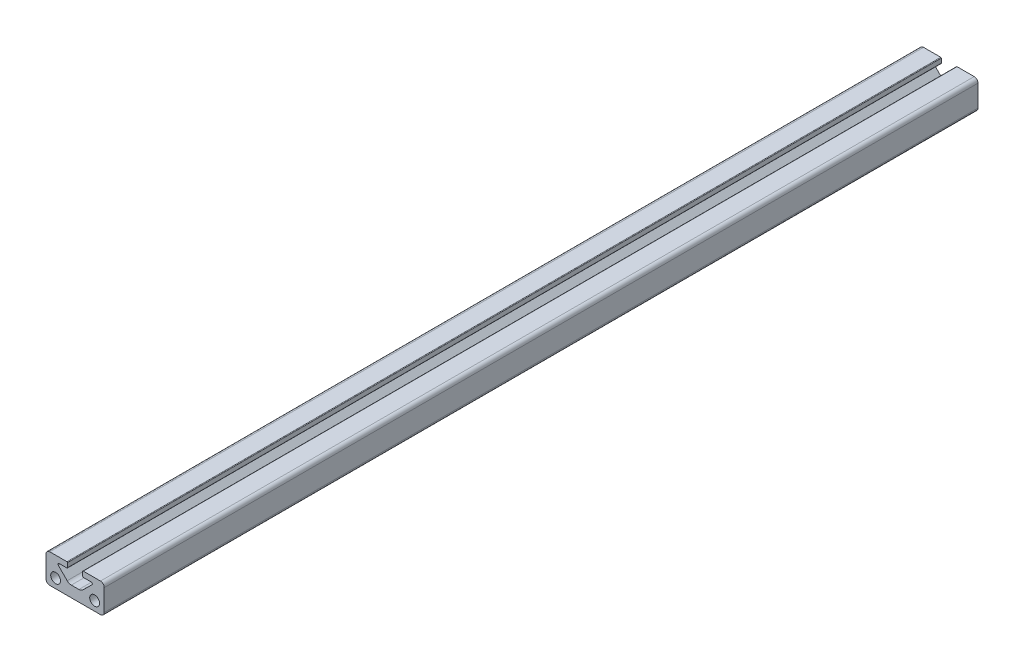
ISO-10303-21;
HEADER;
FILE_DESCRIPTION(('STEP AP214'),'2;1');
FILE_NAME('part.step','',(''),(''),'','','');
FILE_SCHEMA(('AUTOMOTIVE_DESIGN { 1 0 10303 214 1 1 1 1 }'));
ENDSEC;
DATA;
#1=APPLICATION_CONTEXT('core data for automotive mechanical design processes');
#2=APPLICATION_PROTOCOL_DEFINITION('international standard','automotive_design',2000,#1);
#3=PRODUCT_CONTEXT('',#1,'mechanical');
#4=PRODUCT('Part','Part','',(#3));
#5=PRODUCT_RELATED_PRODUCT_CATEGORY('part','',(#4));
#6=PRODUCT_DEFINITION_FORMATION('','',#4);
#7=PRODUCT_DEFINITION_CONTEXT('part definition',#1,'design');
#8=PRODUCT_DEFINITION('design','',#6,#7);
#9=PRODUCT_DEFINITION_SHAPE('','',#8);
#10=(LENGTH_UNIT() NAMED_UNIT(*) SI_UNIT(.MILLI.,.METRE.));
#11=(NAMED_UNIT(*) PLANE_ANGLE_UNIT() SI_UNIT($,.RADIAN.));
#12=(NAMED_UNIT(*) SI_UNIT($,.STERADIAN.) SOLID_ANGLE_UNIT());
#13=UNCERTAINTY_MEASURE_WITH_UNIT(LENGTH_MEASURE(1.E-05),#10,'distance_accuracy_value','');
#14=(GEOMETRIC_REPRESENTATION_CONTEXT(3) GLOBAL_UNCERTAINTY_ASSIGNED_CONTEXT((#13)) GLOBAL_UNIT_ASSIGNED_CONTEXT((#10,
#11,#12)) REPRESENTATION_CONTEXT('',''));
#15=CARTESIAN_POINT('',(0.,0.,0.));
#16=DIRECTION('',(0.,0.,1.));
#17=DIRECTION('',(1.,0.,0.));
#18=AXIS2_PLACEMENT_3D('',#15,#16,#17);
#19=CARTESIAN_POINT('',(-11.049,11.049,190.5));
#20=DIRECTION('',(0.,0.,1.));
#21=DIRECTION('',(1.,0.,0.));
#22=AXIS2_PLACEMENT_3D('',#19,#20,#21);
#23=PLANE('',#22);
#24=CARTESIAN_POINT('',(8.509,4.064,190.5));
#25=DIRECTION('',(0.,0.,1.));
#26=DIRECTION('',(1.,0.,0.));
#27=AXIS2_PLACEMENT_3D('',#24,#25,#26);
#28=CIRCLE('',#27,2.1463);
#29=CARTESIAN_POINT('',(10.6553,4.064,190.5));
#30=VERTEX_POINT('',#29);
#31=EDGE_CURVE('E513',#30,#30,#28,.T.);
#32=ORIENTED_EDGE('',*,*,#31,.F.);
#33=EDGE_LOOP('',(#32));
#34=FACE_BOUND('',#33,.T.);
#35=DIRECTION('',(0.,-1.,0.));
#36=VECTOR('',#35,1.);
#37=CARTESIAN_POINT('',(3.302,12.7,190.5));
#38=LINE('',#37,#36);
#39=CARTESIAN_POINT('',(3.302,12.446,190.5));
#40=VERTEX_POINT('',#39);
#41=CARTESIAN_POINT('',(3.302,10.582863886556,190.5));
#42=VERTEX_POINT('',#41);
#43=EDGE_CURVE('E480',#40,#42,#38,.T.);
#44=ORIENTED_EDGE('',*,*,#43,.T.);
#45=CARTESIAN_POINT('',(3.556,10.582863886556,190.5));
#46=DIRECTION('',(0.,0.,1.));
#47=DIRECTION('',(1.,0.,0.));
#48=AXIS2_PLACEMENT_3D('',#45,#46,#47);
#49=CIRCLE('',#48,0.254);
#50=CARTESIAN_POINT('',(3.556,10.328863886556,190.5));
#51=VERTEX_POINT('',#50);
#52=EDGE_CURVE('E269',#42,#51,#49,.T.);
#53=ORIENTED_EDGE('',*,*,#52,.T.);
#54=DIRECTION('',(1.,0.,0.));
#55=VECTOR('',#54,1.);
#56=CARTESIAN_POINT('',(3.302,10.328863886556,190.5));
#57=LINE('',#56,#55);
#58=CARTESIAN_POINT('',(6.985,10.328863886556,190.5));
#59=VERTEX_POINT('',#58);
#60=EDGE_CURVE('E472',#51,#59,#57,.T.);
#61=ORIENTED_EDGE('',*,*,#60,.T.);
#62=CARTESIAN_POINT('',(6.985,9.82086388655604,190.5));
#63=DIRECTION('',(0.,0.,-1.));
#64=DIRECTION('',(1.,0.,0.));
#65=AXIS2_PLACEMENT_3D('',#62,#63,#64);
#66=CIRCLE('',#65,0.508);
#67=CARTESIAN_POINT('',(7.34421024484277,9.46165364171327,190.5));
#68=VERTEX_POINT('',#67);
#69=EDGE_CURVE('E465',#59,#68,#66,.T.);
#70=ORIENTED_EDGE('',*,*,#69,.T.);
#71=DIRECTION('',(-0.707106781186546,-0.707106781186549,0.));
#72=VECTOR('',#71,1.);
#73=CARTESIAN_POINT('',(7.34421024484277,9.46165364171327,190.5));
#74=LINE('',#73,#72);
#75=CARTESIAN_POINT('',(3.45250537891568,5.56994877578617,190.5));
#76=VERTEX_POINT('',#75);
#77=EDGE_CURVE('E460',#68,#76,#74,.T.);
#78=ORIENTED_EDGE('',*,*,#77,.T.);
#79=CARTESIAN_POINT('',(1.65645415470184,7.366,190.5));
#80=DIRECTION('',(0.,0.,-1.));
#81=DIRECTION('',(1.,0.,0.));
#82=AXIS2_PLACEMENT_3D('',#79,#80,#81);
#83=CIRCLE('',#82,2.54);
#84=CARTESIAN_POINT('',(1.65645415470184,4.826,190.5));
#85=VERTEX_POINT('',#84);
#86=EDGE_CURVE('E456',#76,#85,#83,.T.);
#87=ORIENTED_EDGE('',*,*,#86,.T.);
#88=DIRECTION('',(-1.,0.,0.));
#89=VECTOR('',#88,1.);
#90=CARTESIAN_POINT('',(1.65645415470184,4.826,190.5));
#91=LINE('',#90,#89);
#92=CARTESIAN_POINT('',(-1.65645415470184,4.826,190.5));
#93=VERTEX_POINT('',#92);
#94=EDGE_CURVE('E447',#85,#93,#91,.T.);
#95=ORIENTED_EDGE('',*,*,#94,.T.);
#96=CARTESIAN_POINT('',(-1.65645415470184,7.366,190.5));
#97=DIRECTION('',(0.,0.,-1.));
#98=DIRECTION('',(1.,0.,0.));
#99=AXIS2_PLACEMENT_3D('',#96,#97,#98);
#100=CIRCLE('',#99,2.54);
#101=CARTESIAN_POINT('',(-3.45250537891568,5.56994877578617,190.5));
#102=VERTEX_POINT('',#101);
#103=EDGE_CURVE('E442',#93,#102,#100,.T.);
#104=ORIENTED_EDGE('',*,*,#103,.T.);
#105=DIRECTION('',(-0.707106781186546,0.707106781186549,0.));
#106=VECTOR('',#105,1.);
#107=CARTESIAN_POINT('',(-3.45250537891568,5.56994877578617,190.5));
#108=LINE('',#107,#106);
#109=CARTESIAN_POINT('',(-7.34421024484277,9.46165364171327,190.5));
#110=VERTEX_POINT('',#109);
#111=EDGE_CURVE('E438',#102,#110,#108,.T.);
#112=ORIENTED_EDGE('',*,*,#111,.T.);
#113=CARTESIAN_POINT('',(-6.985,9.82086388655604,190.5));
#114=DIRECTION('',(0.,0.,-1.));
#115=DIRECTION('',(1.,0.,0.));
#116=AXIS2_PLACEMENT_3D('',#113,#114,#115);
#117=CIRCLE('',#116,0.507999999999999);
#118=CARTESIAN_POINT('',(-6.985,10.328863886556,190.5));
#119=VERTEX_POINT('',#118);
#120=EDGE_CURVE('E294',#110,#119,#117,.T.);
#121=ORIENTED_EDGE('',*,*,#120,.T.);
#122=DIRECTION('',(1.,0.,0.));
#123=VECTOR('',#122,1.);
#124=CARTESIAN_POINT('',(-6.985,10.328863886556,190.5));
#125=LINE('',#124,#123);
#126=CARTESIAN_POINT('',(-3.556,10.328863886556,190.5));
#127=VERTEX_POINT('',#126);
#128=EDGE_CURVE('E288',#119,#127,#125,.T.);
#129=ORIENTED_EDGE('',*,*,#128,.T.);
#130=CARTESIAN_POINT('',(-3.556,10.582863886556,190.5));
#131=DIRECTION('',(0.,0.,1.));
#132=DIRECTION('',(1.,0.,0.));
#133=AXIS2_PLACEMENT_3D('',#130,#131,#132);
#134=CIRCLE('',#133,0.254);
#135=CARTESIAN_POINT('',(-3.302,10.582863886556,190.5));
#136=VERTEX_POINT('',#135);
#137=EDGE_CURVE('E263',#127,#136,#134,.T.);
#138=ORIENTED_EDGE('',*,*,#137,.T.);
#139=DIRECTION('',(0.,1.,0.));
#140=VECTOR('',#139,1.);
#141=CARTESIAN_POINT('',(-3.302,12.7,190.5));
#142=LINE('',#141,#140);
#143=CARTESIAN_POINT('',(-3.302,12.446,190.5));
#144=VERTEX_POINT('',#143);
#145=EDGE_CURVE('E297',#136,#144,#142,.T.);
#146=ORIENTED_EDGE('',*,*,#145,.T.);
#147=CARTESIAN_POINT('',(-3.556,12.446,190.5));
#148=DIRECTION('',(0.,0.,1.));
#149=DIRECTION('',(1.,0.,0.));
#150=AXIS2_PLACEMENT_3D('',#147,#148,#149);
#151=CIRCLE('',#150,0.254);
#152=CARTESIAN_POINT('',(-3.556,12.7,190.5));
#153=VERTEX_POINT('',#152);
#154=EDGE_CURVE('E57',#144,#153,#151,.T.);
#155=ORIENTED_EDGE('',*,*,#154,.T.);
#156=DIRECTION('',(-1.,0.,0.));
#157=VECTOR('',#156,1.);
#158=CARTESIAN_POINT('',(-11.049,12.7,190.5));
#159=LINE('',#158,#157);
#160=CARTESIAN_POINT('',(-11.049,12.7,190.5));
#161=VERTEX_POINT('',#160);
#162=EDGE_CURVE('E221',#153,#161,#159,.T.);
#163=ORIENTED_EDGE('',*,*,#162,.T.);
#164=CARTESIAN_POINT('',(-11.049,11.049,190.5));
#165=DIRECTION('',(0.,0.,1.));
#166=DIRECTION('',(1.,0.,0.));
#167=AXIS2_PLACEMENT_3D('',#164,#165,#166);
#168=CIRCLE('',#167,1.651);
#169=CARTESIAN_POINT('',(-12.7,11.049,190.5));
#170=VERTEX_POINT('',#169);
#171=EDGE_CURVE('E216',#161,#170,#168,.T.);
#172=ORIENTED_EDGE('',*,*,#171,.T.);
#173=DIRECTION('',(0.,-1.,0.));
#174=VECTOR('',#173,1.);
#175=CARTESIAN_POINT('',(-12.7,11.049,190.5));
#176=LINE('',#175,#174);
#177=CARTESIAN_POINT('',(-12.7,1.65099999999999,190.5));
#178=VERTEX_POINT('',#177);
#179=EDGE_CURVE('E205',#170,#178,#176,.T.);
#180=ORIENTED_EDGE('',*,*,#179,.T.);
#181=CARTESIAN_POINT('',(-11.049,1.65099999999999,190.5));
#182=DIRECTION('',(0.,0.,1.));
#183=DIRECTION('',(1.,0.,0.));
#184=AXIS2_PLACEMENT_3D('',#181,#182,#183);
#185=CIRCLE('',#184,1.651);
#186=CARTESIAN_POINT('',(-11.049,0.,190.5));
#187=VERTEX_POINT('',#186);
#188=EDGE_CURVE('E215',#178,#187,#185,.T.);
#189=ORIENTED_EDGE('',*,*,#188,.T.);
#190=DIRECTION('',(1.,0.,0.));
#191=VECTOR('',#190,1.);
#192=CARTESIAN_POINT('',(11.049,0.,190.5));
#193=LINE('',#192,#191);
#194=CARTESIAN_POINT('',(11.049,0.,190.5));
#195=VERTEX_POINT('',#194);
#196=EDGE_CURVE('E376',#187,#195,#193,.T.);
#197=ORIENTED_EDGE('',*,*,#196,.T.);
#198=CARTESIAN_POINT('',(11.049,1.651,190.5));
#199=DIRECTION('',(0.,0.,1.));
#200=DIRECTION('',(1.,0.,0.));
#201=AXIS2_PLACEMENT_3D('',#198,#199,#200);
#202=CIRCLE('',#201,1.651);
#203=CARTESIAN_POINT('',(12.7,1.651,190.5));
#204=VERTEX_POINT('',#203);
#205=EDGE_CURVE('E519',#195,#204,#202,.T.);
#206=ORIENTED_EDGE('',*,*,#205,.T.);
#207=DIRECTION('',(0.,1.,0.));
#208=VECTOR('',#207,1.);
#209=CARTESIAN_POINT('',(12.7,1.651,190.5));
#210=LINE('',#209,#208);
#211=CARTESIAN_POINT('',(12.7,11.049,190.5));
#212=VERTEX_POINT('',#211);
#213=EDGE_CURVE('E524',#204,#212,#210,.T.);
#214=ORIENTED_EDGE('',*,*,#213,.T.);
#215=CARTESIAN_POINT('',(11.049,11.049,190.5));
#216=DIRECTION('',(0.,0.,1.));
#217=DIRECTION('',(1.,0.,0.));
#218=AXIS2_PLACEMENT_3D('',#215,#216,#217);
#219=CIRCLE('',#218,1.651);
#220=CARTESIAN_POINT('',(11.049,12.7,190.5));
#221=VERTEX_POINT('',#220);
#222=EDGE_CURVE('E490',#212,#221,#219,.T.);
#223=ORIENTED_EDGE('',*,*,#222,.T.);
#224=DIRECTION('',(-1.,0.,0.));
#225=VECTOR('',#224,1.);
#226=CARTESIAN_POINT('',(3.302,12.7,190.5));
#227=LINE('',#226,#225);
#228=CARTESIAN_POINT('',(3.556,12.7,190.5));
#229=VERTEX_POINT('',#228);
#230=EDGE_CURVE('E485',#221,#229,#227,.T.);
#231=ORIENTED_EDGE('',*,*,#230,.T.);
#232=CARTESIAN_POINT('',(3.556,12.446,190.5));
#233=DIRECTION('',(0.,0.,1.));
#234=DIRECTION('',(1.,0.,0.));
#235=AXIS2_PLACEMENT_3D('',#232,#233,#234);
#236=CIRCLE('',#235,0.254);
#237=EDGE_CURVE('E266',#229,#40,#236,.T.);
#238=ORIENTED_EDGE('',*,*,#237,.T.);
#239=EDGE_LOOP('',(#44,#53,#61,#70,#78,#87,#95,#104,#112,#121,#129,#138,#146,#155,#163,#172,
#180,#189,#197,#206,#214,#223,#231,#238));
#240=FACE_BOUND('',#239,.T.);
#241=CARTESIAN_POINT('',(-8.509,4.064,190.5));
#242=DIRECTION('',(0.,0.,1.));
#243=DIRECTION('',(1.,0.,0.));
#244=AXIS2_PLACEMENT_3D('',#241,#242,#243);
#245=CIRCLE('',#244,2.1463);
#246=CARTESIAN_POINT('',(-6.3627,4.064,190.5));
#247=VERTEX_POINT('',#246);
#248=EDGE_CURVE('E782',#247,#247,#245,.T.);
#249=ORIENTED_EDGE('',*,*,#248,.F.);
#250=EDGE_LOOP('',(#249));
#251=FACE_BOUND('',#250,.T.);
#252=ADVANCED_FACE('F41',(#34,#240,#251),#23,.T.);
#253=CARTESIAN_POINT('',(-11.049,11.049,-190.5));
#254=DIRECTION('',(0.,0.,1.));
#255=DIRECTION('',(1.,0.,0.));
#256=AXIS2_PLACEMENT_3D('',#253,#254,#255);
#257=PLANE('',#256);
#258=DIRECTION('',(1.,0.,0.));
#259=VECTOR('',#258,1.);
#260=CARTESIAN_POINT('',(3.302,10.328863886556,-190.5));
#261=LINE('',#260,#259);
#262=CARTESIAN_POINT('',(3.556,10.328863886556,-190.5));
#263=VERTEX_POINT('',#262);
#264=CARTESIAN_POINT('',(6.985,10.328863886556,-190.5));
#265=VERTEX_POINT('',#264);
#266=EDGE_CURVE('E406',#263,#265,#261,.T.);
#267=ORIENTED_EDGE('',*,*,#266,.F.);
#268=CARTESIAN_POINT('',(3.556,10.582863886556,-190.5));
#269=DIRECTION('',(0.,0.,1.));
#270=DIRECTION('',(1.,0.,0.));
#271=AXIS2_PLACEMENT_3D('',#268,#269,#270);
#272=CIRCLE('',#271,0.254);
#273=CARTESIAN_POINT('',(3.302,10.582863886556,-190.5));
#274=VERTEX_POINT('',#273);
#275=EDGE_CURVE('E251',#263,#274,#272,.F.);
#276=ORIENTED_EDGE('',*,*,#275,.T.);
#277=DIRECTION('',(0.,-1.,0.));
#278=VECTOR('',#277,1.);
#279=CARTESIAN_POINT('',(3.302,12.7,-190.5));
#280=LINE('',#279,#278);
#281=CARTESIAN_POINT('',(3.302,12.446,-190.5));
#282=VERTEX_POINT('',#281);
#283=EDGE_CURVE('E402',#282,#274,#280,.T.);
#284=ORIENTED_EDGE('',*,*,#283,.F.);
#285=CARTESIAN_POINT('',(3.556,12.446,-190.5));
#286=DIRECTION('',(0.,0.,1.));
#287=DIRECTION('',(1.,0.,0.));
#288=AXIS2_PLACEMENT_3D('',#285,#286,#287);
#289=CIRCLE('',#288,0.254);
#290=CARTESIAN_POINT('',(3.556,12.7,-190.5));
#291=VERTEX_POINT('',#290);
#292=EDGE_CURVE('E248',#282,#291,#289,.F.);
#293=ORIENTED_EDGE('',*,*,#292,.T.);
#294=DIRECTION('',(-1.,0.,0.));
#295=VECTOR('',#294,1.);
#296=CARTESIAN_POINT('',(3.302,12.7,-190.5));
#297=LINE('',#296,#295);
#298=CARTESIAN_POINT('',(11.049,12.7,-190.5));
#299=VERTEX_POINT('',#298);
#300=EDGE_CURVE('E398',#299,#291,#297,.T.);
#301=ORIENTED_EDGE('',*,*,#300,.F.);
#302=CARTESIAN_POINT('',(11.049,11.049,-190.5));
#303=DIRECTION('',(0.,0.,1.));
#304=DIRECTION('',(1.,0.,0.));
#305=AXIS2_PLACEMENT_3D('',#302,#303,#304);
#306=CIRCLE('',#305,1.651);
#307=CARTESIAN_POINT('',(12.7,11.049,-190.5));
#308=VERTEX_POINT('',#307);
#309=EDGE_CURVE('E395',#308,#299,#306,.T.);
#310=ORIENTED_EDGE('',*,*,#309,.F.);
#311=DIRECTION('',(0.,1.,0.));
#312=VECTOR('',#311,1.);
#313=CARTESIAN_POINT('',(12.7,1.651,-190.5));
#314=LINE('',#313,#312);
#315=CARTESIAN_POINT('',(12.7,1.651,-190.5));
#316=VERTEX_POINT('',#315);
#317=EDGE_CURVE('E387',#316,#308,#314,.T.);
#318=ORIENTED_EDGE('',*,*,#317,.F.);
#319=CARTESIAN_POINT('',(11.049,1.651,-190.5));
#320=DIRECTION('',(0.,0.,1.));
#321=DIRECTION('',(1.,0.,0.));
#322=AXIS2_PLACEMENT_3D('',#319,#320,#321);
#323=CIRCLE('',#322,1.651);
#324=CARTESIAN_POINT('',(11.049,0.,-190.5));
#325=VERTEX_POINT('',#324);
#326=EDGE_CURVE('E382',#325,#316,#323,.T.);
#327=ORIENTED_EDGE('',*,*,#326,.F.);
#328=DIRECTION('',(1.,0.,0.));
#329=VECTOR('',#328,1.);
#330=CARTESIAN_POINT('',(11.049,0.,-190.5));
#331=LINE('',#330,#329);
#332=CARTESIAN_POINT('',(-11.049,0.,-190.5));
#333=VERTEX_POINT('',#332);
#334=EDGE_CURVE('E375',#333,#325,#331,.T.);
#335=ORIENTED_EDGE('',*,*,#334,.F.);
#336=CARTESIAN_POINT('',(-11.049,1.65099999999999,-190.5));
#337=DIRECTION('',(0.,0.,1.));
#338=DIRECTION('',(1.,0.,0.));
#339=AXIS2_PLACEMENT_3D('',#336,#337,#338);
#340=CIRCLE('',#339,1.651);
#341=CARTESIAN_POINT('',(-12.7,1.65099999999999,-190.5));
#342=VERTEX_POINT('',#341);
#343=EDGE_CURVE('E380',#342,#333,#340,.T.);
#344=ORIENTED_EDGE('',*,*,#343,.F.);
#345=DIRECTION('',(0.,-1.,0.));
#346=VECTOR('',#345,1.);
#347=CARTESIAN_POINT('',(-12.7,11.049,-190.5));
#348=LINE('',#347,#346);
#349=CARTESIAN_POINT('',(-12.7,11.049,-190.5));
#350=VERTEX_POINT('',#349);
#351=EDGE_CURVE('E389',#350,#342,#348,.T.);
#352=ORIENTED_EDGE('',*,*,#351,.F.);
#353=CARTESIAN_POINT('',(-11.049,11.049,-190.5));
#354=DIRECTION('',(0.,0.,1.));
#355=DIRECTION('',(1.,0.,0.));
#356=AXIS2_PLACEMENT_3D('',#353,#354,#355);
#357=CIRCLE('',#356,1.651);
#358=CARTESIAN_POINT('',(-11.049,12.7,-190.5));
#359=VERTEX_POINT('',#358);
#360=EDGE_CURVE('E230',#359,#350,#357,.T.);
#361=ORIENTED_EDGE('',*,*,#360,.F.);
#362=DIRECTION('',(-1.,0.,0.));
#363=VECTOR('',#362,1.);
#364=CARTESIAN_POINT('',(-11.049,12.7,-190.5));
#365=LINE('',#364,#363);
#366=CARTESIAN_POINT('',(-3.556,12.7,-190.5));
#367=VERTEX_POINT('',#366);
#368=EDGE_CURVE('E226',#367,#359,#365,.T.);
#369=ORIENTED_EDGE('',*,*,#368,.F.);
#370=CARTESIAN_POINT('',(-3.556,12.446,-190.5));
#371=DIRECTION('',(0.,0.,1.));
#372=DIRECTION('',(1.,0.,0.));
#373=AXIS2_PLACEMENT_3D('',#370,#371,#372);
#374=CIRCLE('',#373,0.254);
#375=CARTESIAN_POINT('',(-3.302,12.446,-190.5));
#376=VERTEX_POINT('',#375);
#377=EDGE_CURVE('E237',#367,#376,#374,.F.);
#378=ORIENTED_EDGE('',*,*,#377,.T.);
#379=DIRECTION('',(0.,1.,0.));
#380=VECTOR('',#379,1.);
#381=CARTESIAN_POINT('',(-3.302,12.7,-190.5));
#382=LINE('',#381,#380);
#383=CARTESIAN_POINT('',(-3.302,10.582863886556,-190.5));
#384=VERTEX_POINT('',#383);
#385=EDGE_CURVE('E303',#384,#376,#382,.T.);
#386=ORIENTED_EDGE('',*,*,#385,.F.);
#387=CARTESIAN_POINT('',(-3.556,10.582863886556,-190.5));
#388=DIRECTION('',(0.,0.,1.));
#389=DIRECTION('',(1.,0.,0.));
#390=AXIS2_PLACEMENT_3D('',#387,#388,#389);
#391=CIRCLE('',#390,0.254);
#392=CARTESIAN_POINT('',(-3.556,10.328863886556,-190.5));
#393=VERTEX_POINT('',#392);
#394=EDGE_CURVE('E245',#384,#393,#391,.F.);
#395=ORIENTED_EDGE('',*,*,#394,.T.);
#396=DIRECTION('',(1.,0.,0.));
#397=VECTOR('',#396,1.);
#398=CARTESIAN_POINT('',(-6.985,10.328863886556,-190.5));
#399=LINE('',#398,#397);
#400=CARTESIAN_POINT('',(-6.985,10.328863886556,-190.5));
#401=VERTEX_POINT('',#400);
#402=EDGE_CURVE('E290',#401,#393,#399,.T.);
#403=ORIENTED_EDGE('',*,*,#402,.F.);
#404=CARTESIAN_POINT('',(-6.985,9.82086388655604,-190.5));
#405=DIRECTION('',(0.,0.,-1.));
#406=DIRECTION('',(1.,0.,0.));
#407=AXIS2_PLACEMENT_3D('',#404,#405,#406);
#408=CIRCLE('',#407,0.507999999999999);
#409=CARTESIAN_POINT('',(-7.34421024484277,9.46165364171327,-190.5));
#410=VERTEX_POINT('',#409);
#411=EDGE_CURVE('E314',#410,#401,#408,.T.);
#412=ORIENTED_EDGE('',*,*,#411,.F.);
#413=DIRECTION('',(-0.707106781186546,0.707106781186549,0.));
#414=VECTOR('',#413,1.);
#415=CARTESIAN_POINT('',(-3.45250537891568,5.56994877578617,-190.5));
#416=LINE('',#415,#414);
#417=CARTESIAN_POINT('',(-3.45250537891568,5.56994877578617,-190.5));
#418=VERTEX_POINT('',#417);
#419=EDGE_CURVE('E424',#418,#410,#416,.T.);
#420=ORIENTED_EDGE('',*,*,#419,.F.);
#421=CARTESIAN_POINT('',(-1.65645415470184,7.366,-190.5));
#422=DIRECTION('',(0.,0.,-1.));
#423=DIRECTION('',(1.,0.,0.));
#424=AXIS2_PLACEMENT_3D('',#421,#422,#423);
#425=CIRCLE('',#424,2.54);
#426=CARTESIAN_POINT('',(-1.65645415470184,4.826,-190.5));
#427=VERTEX_POINT('',#426);
#428=EDGE_CURVE('E421',#427,#418,#425,.T.);
#429=ORIENTED_EDGE('',*,*,#428,.F.);
#430=DIRECTION('',(-1.,0.,0.));
#431=VECTOR('',#430,1.);
#432=CARTESIAN_POINT('',(1.65645415470184,4.826,-190.5));
#433=LINE('',#432,#431);
#434=CARTESIAN_POINT('',(1.65645415470184,4.826,-190.5));
#435=VERTEX_POINT('',#434);
#436=EDGE_CURVE('E418',#435,#427,#433,.T.);
#437=ORIENTED_EDGE('',*,*,#436,.F.);
#438=CARTESIAN_POINT('',(1.65645415470184,7.366,-190.5));
#439=DIRECTION('',(0.,0.,-1.));
#440=DIRECTION('',(1.,0.,0.));
#441=AXIS2_PLACEMENT_3D('',#438,#439,#440);
#442=CIRCLE('',#441,2.54);
#443=CARTESIAN_POINT('',(3.45250537891568,5.56994877578617,-190.5));
#444=VERTEX_POINT('',#443);
#445=EDGE_CURVE('E415',#444,#435,#442,.T.);
#446=ORIENTED_EDGE('',*,*,#445,.F.);
#447=DIRECTION('',(-0.707106781186546,-0.707106781186549,0.));
#448=VECTOR('',#447,1.);
#449=CARTESIAN_POINT('',(7.34421024484277,9.46165364171327,-190.5));
#450=LINE('',#449,#448);
#451=CARTESIAN_POINT('',(7.34421024484277,9.46165364171327,-190.5));
#452=VERTEX_POINT('',#451);
#453=EDGE_CURVE('E412',#452,#444,#450,.T.);
#454=ORIENTED_EDGE('',*,*,#453,.F.);
#455=CARTESIAN_POINT('',(6.985,9.82086388655604,-190.5));
#456=DIRECTION('',(0.,0.,-1.));
#457=DIRECTION('',(1.,0.,0.));
#458=AXIS2_PLACEMENT_3D('',#455,#456,#457);
#459=CIRCLE('',#458,0.508);
#460=EDGE_CURVE('E409',#265,#452,#459,.T.);
#461=ORIENTED_EDGE('',*,*,#460,.F.);
#462=EDGE_LOOP('',(#267,#276,#284,#293,#301,#310,#318,#327,#335,#344,#352,#361,#369,#378,#386,
#395,#403,#412,#420,#429,#437,#446,#454,#461));
#463=FACE_BOUND('',#462,.T.);
#464=CARTESIAN_POINT('',(8.509,4.064,-190.5));
#465=DIRECTION('',(0.,0.,1.));
#466=DIRECTION('',(1.,0.,0.));
#467=AXIS2_PLACEMENT_3D('',#464,#465,#466);
#468=CIRCLE('',#467,2.1463);
#469=CARTESIAN_POINT('',(10.6553,4.064,-190.5));
#470=VERTEX_POINT('',#469);
#471=EDGE_CURVE('E790',#470,#470,#468,.T.);
#472=ORIENTED_EDGE('',*,*,#471,.T.);
#473=EDGE_LOOP('',(#472));
#474=FACE_BOUND('',#473,.T.);
#475=CARTESIAN_POINT('',(-8.509,4.064,-190.5));
#476=DIRECTION('',(0.,0.,1.));
#477=DIRECTION('',(1.,0.,0.));
#478=AXIS2_PLACEMENT_3D('',#475,#476,#477);
#479=CIRCLE('',#478,2.1463);
#480=CARTESIAN_POINT('',(-6.3627,4.064,-190.5));
#481=VERTEX_POINT('',#480);
#482=EDGE_CURVE('E785',#481,#481,#479,.T.);
#483=ORIENTED_EDGE('',*,*,#482,.T.);
#484=EDGE_LOOP('',(#483));
#485=FACE_BOUND('',#484,.T.);
#486=ADVANCED_FACE('F306',(#463,#474,#485),#257,.F.);
#487=CARTESIAN_POINT('',(-11.049,11.049,190.5));
#488=DIRECTION('',(0.,0.,-1.));
#489=DIRECTION('',(-1.,0.,0.));
#490=AXIS2_PLACEMENT_3D('',#487,#488,#489);
#491=CYLINDRICAL_SURFACE('',#490,1.651);
#492=ORIENTED_EDGE('',*,*,#360,.T.);
#493=DIRECTION('',(0.,0.,-1.));
#494=VECTOR('',#493,1.);
#495=CARTESIAN_POINT('',(-12.7,11.049,190.5));
#496=LINE('',#495,#494);
#497=EDGE_CURVE('E209',#170,#350,#496,.T.);
#498=ORIENTED_EDGE('',*,*,#497,.F.);
#499=ORIENTED_EDGE('',*,*,#171,.F.);
#500=DIRECTION('',(0.,0.,-1.));
#501=VECTOR('',#500,1.);
#502=CARTESIAN_POINT('',(-11.049,12.7,190.5));
#503=LINE('',#502,#501);
#504=EDGE_CURVE('E318',#161,#359,#503,.T.);
#505=ORIENTED_EDGE('',*,*,#504,.T.);
#506=EDGE_LOOP('',(#492,#498,#499,#505));
#507=FACE_BOUND('',#506,.T.);
#508=ADVANCED_FACE('F228',(#507),#491,.T.);
#509=CARTESIAN_POINT('',(-12.7,11.049,190.5));
#510=DIRECTION('',(1.,0.,0.));
#511=DIRECTION('',(0.,0.,-1.));
#512=AXIS2_PLACEMENT_3D('',#509,#510,#511);
#513=PLANE('',#512);
#514=ORIENTED_EDGE('',*,*,#351,.T.);
#515=DIRECTION('',(0.,0.,-1.));
#516=VECTOR('',#515,1.);
#517=CARTESIAN_POINT('',(-12.7,1.65099999999999,190.5));
#518=LINE('',#517,#516);
#519=EDGE_CURVE('E212',#178,#342,#518,.T.);
#520=ORIENTED_EDGE('',*,*,#519,.F.);
#521=ORIENTED_EDGE('',*,*,#179,.F.);
#522=ORIENTED_EDGE('',*,*,#497,.T.);
#523=EDGE_LOOP('',(#514,#520,#521,#522));
#524=FACE_BOUND('',#523,.T.);
#525=ADVANCED_FACE('F207',(#524),#513,.F.);
#526=CARTESIAN_POINT('',(-11.049,1.65099999999999,190.5));
#527=DIRECTION('',(0.,0.,-1.));
#528=DIRECTION('',(-1.,0.,0.));
#529=AXIS2_PLACEMENT_3D('',#526,#527,#528);
#530=CYLINDRICAL_SURFACE('',#529,1.651);
#531=ORIENTED_EDGE('',*,*,#343,.T.);
#532=DIRECTION('',(0.,0.,-1.));
#533=VECTOR('',#532,1.);
#534=CARTESIAN_POINT('',(-11.049,0.,190.5));
#535=LINE('',#534,#533);
#536=EDGE_CURVE('E239',#187,#333,#535,.T.);
#537=ORIENTED_EDGE('',*,*,#536,.F.);
#538=ORIENTED_EDGE('',*,*,#188,.F.);
#539=ORIENTED_EDGE('',*,*,#519,.T.);
#540=EDGE_LOOP('',(#531,#537,#538,#539));
#541=FACE_BOUND('',#540,.T.);
#542=ADVANCED_FACE('F515',(#541),#530,.T.);
#543=CARTESIAN_POINT('',(11.049,0.,190.5));
#544=DIRECTION('',(0.,1.,0.));
#545=DIRECTION('',(-1.,0.,0.));
#546=AXIS2_PLACEMENT_3D('',#543,#544,#545);
#547=PLANE('',#546);
#548=ORIENTED_EDGE('',*,*,#334,.T.);
#549=DIRECTION('',(0.,0.,-1.));
#550=VECTOR('',#549,1.);
#551=CARTESIAN_POINT('',(11.049,0.,190.5));
#552=LINE('',#551,#550);
#553=EDGE_CURVE('E364',#195,#325,#552,.T.);
#554=ORIENTED_EDGE('',*,*,#553,.F.);
#555=ORIENTED_EDGE('',*,*,#196,.F.);
#556=ORIENTED_EDGE('',*,*,#536,.T.);
#557=EDGE_LOOP('',(#548,#554,#555,#556));
#558=FACE_BOUND('',#557,.T.);
#559=ADVANCED_FACE('F373',(#558),#547,.F.);
#560=CARTESIAN_POINT('',(11.049,1.651,190.5));
#561=DIRECTION('',(0.,0.,-1.));
#562=DIRECTION('',(-1.,0.,0.));
#563=AXIS2_PLACEMENT_3D('',#560,#561,#562);
#564=CYLINDRICAL_SURFACE('',#563,1.651);
#565=ORIENTED_EDGE('',*,*,#326,.T.);
#566=DIRECTION('',(0.,0.,-1.));
#567=VECTOR('',#566,1.);
#568=CARTESIAN_POINT('',(12.7,1.651,190.5));
#569=LINE('',#568,#567);
#570=EDGE_CURVE('E360',#204,#316,#569,.T.);
#571=ORIENTED_EDGE('',*,*,#570,.F.);
#572=ORIENTED_EDGE('',*,*,#205,.F.);
#573=ORIENTED_EDGE('',*,*,#553,.T.);
#574=EDGE_LOOP('',(#565,#571,#572,#573));
#575=FACE_BOUND('',#574,.T.);
#576=ADVANCED_FACE('F546',(#575),#564,.T.);
#577=CARTESIAN_POINT('',(12.7,1.651,190.5));
#578=DIRECTION('',(-1.,0.,0.));
#579=DIRECTION('',(0.,0.,1.));
#580=AXIS2_PLACEMENT_3D('',#577,#578,#579);
#581=PLANE('',#580);
#582=ORIENTED_EDGE('',*,*,#317,.T.);
#583=DIRECTION('',(0.,0.,-1.));
#584=VECTOR('',#583,1.);
#585=CARTESIAN_POINT('',(12.7,11.049,190.5));
#586=LINE('',#585,#584);
#587=EDGE_CURVE('E356',#212,#308,#586,.T.);
#588=ORIENTED_EDGE('',*,*,#587,.F.);
#589=ORIENTED_EDGE('',*,*,#213,.F.);
#590=ORIENTED_EDGE('',*,*,#570,.T.);
#591=EDGE_LOOP('',(#582,#588,#589,#590));
#592=FACE_BOUND('',#591,.T.);
#593=ADVANCED_FACE('F542',(#592),#581,.F.);
#594=CARTESIAN_POINT('',(11.049,11.049,190.5));
#595=DIRECTION('',(0.,0.,-1.));
#596=DIRECTION('',(-1.,0.,0.));
#597=AXIS2_PLACEMENT_3D('',#594,#595,#596);
#598=CYLINDRICAL_SURFACE('',#597,1.651);
#599=ORIENTED_EDGE('',*,*,#309,.T.);
#600=DIRECTION('',(0.,0.,-1.));
#601=VECTOR('',#600,1.);
#602=CARTESIAN_POINT('',(11.049,12.7,190.5));
#603=LINE('',#602,#601);
#604=EDGE_CURVE('E352',#221,#299,#603,.T.);
#605=ORIENTED_EDGE('',*,*,#604,.F.);
#606=ORIENTED_EDGE('',*,*,#222,.F.);
#607=ORIENTED_EDGE('',*,*,#587,.T.);
#608=EDGE_LOOP('',(#599,#605,#606,#607));
#609=FACE_BOUND('',#608,.T.);
#610=ADVANCED_FACE('F533',(#609),#598,.T.);
#611=CARTESIAN_POINT('',(3.302,12.7,190.5));
#612=DIRECTION('',(0.,-1.,0.));
#613=DIRECTION('',(1.,0.,0.));
#614=AXIS2_PLACEMENT_3D('',#611,#612,#613);
#615=PLANE('',#614);
#616=ORIENTED_EDGE('',*,*,#300,.T.);
#617=DIRECTION('',(0.,0.,-1.));
#618=VECTOR('',#617,1.);
#619=CARTESIAN_POINT('',(3.556,12.7,190.5));
#620=LINE('',#619,#618);
#621=EDGE_CURVE('E272',#291,#229,#620,.F.);
#622=ORIENTED_EDGE('',*,*,#621,.T.);
#623=ORIENTED_EDGE('',*,*,#230,.F.);
#624=ORIENTED_EDGE('',*,*,#604,.T.);
#625=EDGE_LOOP('',(#616,#622,#623,#624));
#626=FACE_BOUND('',#625,.T.);
#627=ADVANCED_FACE('F537',(#626),#615,.F.);
#628=CARTESIAN_POINT('',(3.302,12.7,190.5));
#629=DIRECTION('',(1.,0.,0.));
#630=DIRECTION('',(0.,1.,0.));
#631=AXIS2_PLACEMENT_3D('',#628,#629,#630);
#632=PLANE('',#631);
#633=ORIENTED_EDGE('',*,*,#283,.T.);
#634=DIRECTION('',(0.,0.,-1.));
#635=VECTOR('',#634,1.);
#636=CARTESIAN_POINT('',(3.302,10.582863886556,190.5));
#637=LINE('',#636,#635);
#638=EDGE_CURVE('E258',#274,#42,#637,.F.);
#639=ORIENTED_EDGE('',*,*,#638,.T.);
#640=ORIENTED_EDGE('',*,*,#43,.F.);
#641=DIRECTION('',(0.,0.,-1.));
#642=VECTOR('',#641,1.);
#643=CARTESIAN_POINT('',(3.302,12.446,190.5));
#644=LINE('',#643,#642);
#645=EDGE_CURVE('E254',#40,#282,#644,.T.);
#646=ORIENTED_EDGE('',*,*,#645,.T.);
#647=EDGE_LOOP('',(#633,#639,#640,#646));
#648=FACE_BOUND('',#647,.T.);
#649=ADVANCED_FACE('F479',(#648),#632,.F.);
#650=CARTESIAN_POINT('',(3.302,10.328863886556,190.5));
#651=DIRECTION('',(0.,1.,0.));
#652=DIRECTION('',(0.,0.,1.));
#653=AXIS2_PLACEMENT_3D('',#650,#651,#652);
#654=PLANE('',#653);
#655=ORIENTED_EDGE('',*,*,#60,.F.);
#656=DIRECTION('',(0.,0.,-1.));
#657=VECTOR('',#656,1.);
#658=CARTESIAN_POINT('',(3.556,10.328863886556,190.5));
#659=LINE('',#658,#657);
#660=EDGE_CURVE('E232',#51,#263,#659,.T.);
#661=ORIENTED_EDGE('',*,*,#660,.T.);
#662=ORIENTED_EDGE('',*,*,#266,.T.);
#663=DIRECTION('',(0.,0.,-1.));
#664=VECTOR('',#663,1.);
#665=CARTESIAN_POINT('',(6.985,10.328863886556,190.5));
#666=LINE('',#665,#664);
#667=EDGE_CURVE('E348',#59,#265,#666,.T.);
#668=ORIENTED_EDGE('',*,*,#667,.F.);
#669=EDGE_LOOP('',(#655,#661,#662,#668));
#670=FACE_BOUND('',#669,.T.);
#671=ADVANCED_FACE('F470',(#670),#654,.F.);
#672=CARTESIAN_POINT('',(6.985,9.82086388655604,190.5));
#673=DIRECTION('',(0.,0.,-1.));
#674=DIRECTION('',(-1.,0.,0.));
#675=AXIS2_PLACEMENT_3D('',#672,#673,#674);
#676=CYLINDRICAL_SURFACE('',#675,0.508);
#677=ORIENTED_EDGE('',*,*,#460,.T.);
#678=DIRECTION('',(0.,0.,-1.));
#679=VECTOR('',#678,1.);
#680=CARTESIAN_POINT('',(7.34421024484277,9.46165364171327,190.5));
#681=LINE('',#680,#679);
#682=EDGE_CURVE('E344',#68,#452,#681,.T.);
#683=ORIENTED_EDGE('',*,*,#682,.F.);
#684=ORIENTED_EDGE('',*,*,#69,.F.);
#685=ORIENTED_EDGE('',*,*,#667,.T.);
#686=EDGE_LOOP('',(#677,#683,#684,#685));
#687=FACE_BOUND('',#686,.T.);
#688=ADVANCED_FACE('F464',(#687),#676,.F.);
#689=CARTESIAN_POINT('',(7.34421024484277,9.46165364171327,190.5));
#690=DIRECTION('',(0.707106781186549,-0.707106781186546,0.));
#691=DIRECTION('',(0.707106781186546,0.707106781186549,0.));
#692=AXIS2_PLACEMENT_3D('',#689,#690,#691);
#693=PLANE('',#692);
#694=ORIENTED_EDGE('',*,*,#453,.T.);
#695=DIRECTION('',(0.,0.,-1.));
#696=VECTOR('',#695,1.);
#697=CARTESIAN_POINT('',(3.45250537891568,5.56994877578617,190.5));
#698=LINE('',#697,#696);
#699=EDGE_CURVE('E340',#76,#444,#698,.T.);
#700=ORIENTED_EDGE('',*,*,#699,.F.);
#701=ORIENTED_EDGE('',*,*,#77,.F.);
#702=ORIENTED_EDGE('',*,*,#682,.T.);
#703=EDGE_LOOP('',(#694,#700,#701,#702));
#704=FACE_BOUND('',#703,.T.);
#705=ADVANCED_FACE('F459',(#704),#693,.F.);
#706=CARTESIAN_POINT('',(1.65645415470184,7.366,190.5));
#707=DIRECTION('',(0.,0.,-1.));
#708=DIRECTION('',(-1.,0.,0.));
#709=AXIS2_PLACEMENT_3D('',#706,#707,#708);
#710=CYLINDRICAL_SURFACE('',#709,2.54);
#711=ORIENTED_EDGE('',*,*,#445,.T.);
#712=DIRECTION('',(0.,0.,-1.));
#713=VECTOR('',#712,1.);
#714=CARTESIAN_POINT('',(1.65645415470184,4.826,190.5));
#715=LINE('',#714,#713);
#716=EDGE_CURVE('E336',#85,#435,#715,.T.);
#717=ORIENTED_EDGE('',*,*,#716,.F.);
#718=ORIENTED_EDGE('',*,*,#86,.F.);
#719=ORIENTED_EDGE('',*,*,#699,.T.);
#720=EDGE_LOOP('',(#711,#717,#718,#719));
#721=FACE_BOUND('',#720,.T.);
#722=ADVANCED_FACE('F453',(#721),#710,.F.);
#723=CARTESIAN_POINT('',(1.65645415470184,4.826,190.5));
#724=DIRECTION('',(0.,-1.,0.));
#725=DIRECTION('',(1.,0.,0.));
#726=AXIS2_PLACEMENT_3D('',#723,#724,#725);
#727=PLANE('',#726);
#728=ORIENTED_EDGE('',*,*,#436,.T.);
#729=DIRECTION('',(0.,0.,-1.));
#730=VECTOR('',#729,1.);
#731=CARTESIAN_POINT('',(-1.65645415470184,4.826,190.5));
#732=LINE('',#731,#730);
#733=EDGE_CURVE('E332',#93,#427,#732,.T.);
#734=ORIENTED_EDGE('',*,*,#733,.F.);
#735=ORIENTED_EDGE('',*,*,#94,.F.);
#736=ORIENTED_EDGE('',*,*,#716,.T.);
#737=EDGE_LOOP('',(#728,#734,#735,#736));
#738=FACE_BOUND('',#737,.T.);
#739=ADVANCED_FACE('F446',(#738),#727,.F.);
#740=CARTESIAN_POINT('',(-1.65645415470184,7.366,190.5));
#741=DIRECTION('',(0.,0.,-1.));
#742=DIRECTION('',(-1.,0.,0.));
#743=AXIS2_PLACEMENT_3D('',#740,#741,#742);
#744=CYLINDRICAL_SURFACE('',#743,2.54);
#745=ORIENTED_EDGE('',*,*,#428,.T.);
#746=DIRECTION('',(0.,0.,-1.));
#747=VECTOR('',#746,1.);
#748=CARTESIAN_POINT('',(-3.45250537891568,5.56994877578617,190.5));
#749=LINE('',#748,#747);
#750=EDGE_CURVE('E328',#102,#418,#749,.T.);
#751=ORIENTED_EDGE('',*,*,#750,.F.);
#752=ORIENTED_EDGE('',*,*,#103,.F.);
#753=ORIENTED_EDGE('',*,*,#733,.T.);
#754=EDGE_LOOP('',(#745,#751,#752,#753));
#755=FACE_BOUND('',#754,.T.);
#756=ADVANCED_FACE('F441',(#755),#744,.F.);
#757=CARTESIAN_POINT('',(-3.45250537891568,5.56994877578617,190.5));
#758=DIRECTION('',(-0.707106781186549,-0.707106781186546,0.));
#759=DIRECTION('',(0.707106781186546,-0.707106781186549,0.));
#760=AXIS2_PLACEMENT_3D('',#757,#758,#759);
#761=PLANE('',#760);
#762=ORIENTED_EDGE('',*,*,#419,.T.);
#763=DIRECTION('',(0.,0.,-1.));
#764=VECTOR('',#763,1.);
#765=CARTESIAN_POINT('',(-7.34421024484277,9.46165364171327,190.5));
#766=LINE('',#765,#764);
#767=EDGE_CURVE('E324',#110,#410,#766,.T.);
#768=ORIENTED_EDGE('',*,*,#767,.F.);
#769=ORIENTED_EDGE('',*,*,#111,.F.);
#770=ORIENTED_EDGE('',*,*,#750,.T.);
#771=EDGE_LOOP('',(#762,#768,#769,#770));
#772=FACE_BOUND('',#771,.T.);
#773=ADVANCED_FACE('F435',(#772),#761,.F.);
#774=CARTESIAN_POINT('',(-6.985,9.82086388655604,190.5));
#775=DIRECTION('',(0.,0.,-1.));
#776=DIRECTION('',(-1.,0.,0.));
#777=AXIS2_PLACEMENT_3D('',#774,#775,#776);
#778=CYLINDRICAL_SURFACE('',#777,0.507999999999999);
#779=ORIENTED_EDGE('',*,*,#411,.T.);
#780=DIRECTION('',(0.,0.,-1.));
#781=VECTOR('',#780,1.);
#782=CARTESIAN_POINT('',(-6.985,10.328863886556,190.5));
#783=LINE('',#782,#781);
#784=EDGE_CURVE('E321',#119,#401,#783,.T.);
#785=ORIENTED_EDGE('',*,*,#784,.F.);
#786=ORIENTED_EDGE('',*,*,#120,.F.);
#787=ORIENTED_EDGE('',*,*,#767,.T.);
#788=EDGE_LOOP('',(#779,#785,#786,#787));
#789=FACE_BOUND('',#788,.T.);
#790=ADVANCED_FACE('F429',(#789),#778,.F.);
#791=CARTESIAN_POINT('',(-6.985,10.328863886556,190.5));
#792=DIRECTION('',(0.,1.,0.));
#793=DIRECTION('',(-1.,0.,0.));
#794=AXIS2_PLACEMENT_3D('',#791,#792,#793);
#795=PLANE('',#794);
#796=ORIENTED_EDGE('',*,*,#402,.T.);
#797=DIRECTION('',(0.,0.,-1.));
#798=VECTOR('',#797,1.);
#799=CARTESIAN_POINT('',(-3.556,10.328863886556,190.5));
#800=LINE('',#799,#798);
#801=EDGE_CURVE('E50',#393,#127,#800,.F.);
#802=ORIENTED_EDGE('',*,*,#801,.T.);
#803=ORIENTED_EDGE('',*,*,#128,.F.);
#804=ORIENTED_EDGE('',*,*,#784,.T.);
#805=EDGE_LOOP('',(#796,#802,#803,#804));
#806=FACE_BOUND('',#805,.T.);
#807=ADVANCED_FACE('F286',(#806),#795,.F.);
#808=CARTESIAN_POINT('',(-3.302,12.7,190.5));
#809=DIRECTION('',(-1.,0.,0.));
#810=DIRECTION('',(0.,-1.,0.));
#811=AXIS2_PLACEMENT_3D('',#808,#809,#810);
#812=PLANE('',#811);
#813=ORIENTED_EDGE('',*,*,#145,.F.);
#814=DIRECTION('',(0.,0.,-1.));
#815=VECTOR('',#814,1.);
#816=CARTESIAN_POINT('',(-3.302,10.582863886556,190.5));
#817=LINE('',#816,#815);
#818=EDGE_CURVE('E277',#136,#384,#817,.T.);
#819=ORIENTED_EDGE('',*,*,#818,.T.);
#820=ORIENTED_EDGE('',*,*,#385,.T.);
#821=DIRECTION('',(0.,0.,-1.));
#822=VECTOR('',#821,1.);
#823=CARTESIAN_POINT('',(-3.302,12.446,190.5));
#824=LINE('',#823,#822);
#825=EDGE_CURVE('E65',#376,#144,#824,.F.);
#826=ORIENTED_EDGE('',*,*,#825,.T.);
#827=EDGE_LOOP('',(#813,#819,#820,#826));
#828=FACE_BOUND('',#827,.T.);
#829=ADVANCED_FACE('F302',(#828),#812,.F.);
#830=CARTESIAN_POINT('',(-11.049,12.7,190.5));
#831=DIRECTION('',(0.,-1.,0.));
#832=DIRECTION('',(1.,0.,0.));
#833=AXIS2_PLACEMENT_3D('',#830,#831,#832);
#834=PLANE('',#833);
#835=ORIENTED_EDGE('',*,*,#162,.F.);
#836=DIRECTION('',(0.,0.,-1.));
#837=VECTOR('',#836,1.);
#838=CARTESIAN_POINT('',(-3.556,12.7,190.5));
#839=LINE('',#838,#837);
#840=EDGE_CURVE('E11',#153,#367,#839,.T.);
#841=ORIENTED_EDGE('',*,*,#840,.T.);
#842=ORIENTED_EDGE('',*,*,#368,.T.);
#843=ORIENTED_EDGE('',*,*,#504,.F.);
#844=EDGE_LOOP('',(#835,#841,#842,#843));
#845=FACE_BOUND('',#844,.T.);
#846=ADVANCED_FACE('F567',(#845),#834,.F.);
#847=CARTESIAN_POINT('',(8.509,4.064,190.5));
#848=DIRECTION('',(0.,0.,-1.));
#849=DIRECTION('',(-1.,0.,0.));
#850=AXIS2_PLACEMENT_3D('',#847,#848,#849);
#851=CYLINDRICAL_SURFACE('',#850,2.1463);
#852=ORIENTED_EDGE('',*,*,#31,.T.);
#853=EDGE_LOOP('',(#852));
#854=FACE_BOUND('',#853,.T.);
#855=ORIENTED_EDGE('',*,*,#471,.F.);
#856=EDGE_LOOP('',(#855));
#857=FACE_BOUND('',#856,.T.);
#858=ADVANCED_FACE('F564',(#854,#857),#851,.F.);
#859=CARTESIAN_POINT('',(-8.509,4.064,190.5));
#860=DIRECTION('',(0.,0.,-1.));
#861=DIRECTION('',(-1.,0.,0.));
#862=AXIS2_PLACEMENT_3D('',#859,#860,#861);
#863=CYLINDRICAL_SURFACE('',#862,2.1463);
#864=ORIENTED_EDGE('',*,*,#248,.T.);
#865=EDGE_LOOP('',(#864));
#866=FACE_BOUND('',#865,.T.);
#867=ORIENTED_EDGE('',*,*,#482,.F.);
#868=EDGE_LOOP('',(#867));
#869=FACE_BOUND('',#868,.T.);
#870=ADVANCED_FACE('F660',(#866,#869),#863,.F.);
#871=CARTESIAN_POINT('',(3.556,10.582863886556,190.5));
#872=DIRECTION('',(0.,0.,-1.));
#873=DIRECTION('',(-1.,0.,0.));
#874=AXIS2_PLACEMENT_3D('',#871,#872,#873);
#875=CYLINDRICAL_SURFACE('',#874,0.254);
#876=ORIENTED_EDGE('',*,*,#52,.F.);
#877=ORIENTED_EDGE('',*,*,#638,.F.);
#878=ORIENTED_EDGE('',*,*,#275,.F.);
#879=ORIENTED_EDGE('',*,*,#660,.F.);
#880=EDGE_LOOP('',(#876,#877,#878,#879));
#881=FACE_BOUND('',#880,.T.);
#882=ADVANCED_FACE('F475',(#881),#875,.T.);
#883=CARTESIAN_POINT('',(3.556,12.446,190.5));
#884=DIRECTION('',(0.,0.,-1.));
#885=DIRECTION('',(-1.,0.,0.));
#886=AXIS2_PLACEMENT_3D('',#883,#884,#885);
#887=CYLINDRICAL_SURFACE('',#886,0.254);
#888=ORIENTED_EDGE('',*,*,#237,.F.);
#889=ORIENTED_EDGE('',*,*,#621,.F.);
#890=ORIENTED_EDGE('',*,*,#292,.F.);
#891=ORIENTED_EDGE('',*,*,#645,.F.);
#892=EDGE_LOOP('',(#888,#889,#890,#891));
#893=FACE_BOUND('',#892,.T.);
#894=ADVANCED_FACE('F540',(#893),#887,.T.);
#895=CARTESIAN_POINT('',(-3.556,10.582863886556,190.5));
#896=DIRECTION('',(0.,0.,-1.));
#897=DIRECTION('',(-1.,0.,0.));
#898=AXIS2_PLACEMENT_3D('',#895,#896,#897);
#899=CYLINDRICAL_SURFACE('',#898,0.254);
#900=ORIENTED_EDGE('',*,*,#137,.F.);
#901=ORIENTED_EDGE('',*,*,#801,.F.);
#902=ORIENTED_EDGE('',*,*,#394,.F.);
#903=ORIENTED_EDGE('',*,*,#818,.F.);
#904=EDGE_LOOP('',(#900,#901,#902,#903));
#905=FACE_BOUND('',#904,.T.);
#906=ADVANCED_FACE('F300',(#905),#899,.T.);
#907=CARTESIAN_POINT('',(-3.556,12.446,190.5));
#908=DIRECTION('',(0.,0.,-1.));
#909=DIRECTION('',(-1.,0.,0.));
#910=AXIS2_PLACEMENT_3D('',#907,#908,#909);
#911=CYLINDRICAL_SURFACE('',#910,0.254);
#912=ORIENTED_EDGE('',*,*,#154,.F.);
#913=ORIENTED_EDGE('',*,*,#825,.F.);
#914=ORIENTED_EDGE('',*,*,#377,.F.);
#915=ORIENTED_EDGE('',*,*,#840,.F.);
#916=EDGE_LOOP('',(#912,#913,#914,#915));
#917=FACE_BOUND('',#916,.T.);
#918=ADVANCED_FACE('F43',(#917),#911,.T.);
#919=CLOSED_SHELL('',(#252,#486,#508,#525,#542,#559,#576,#593,#610,#627,#649,#671,#688,#705,
#722,#739,#756,#773,#790,#807,#829,#846,#858,#870,#882,#894,#906,#918));
#920=MANIFOLD_SOLID_BREP('B2',#919);
#921=ADVANCED_BREP_SHAPE_REPRESENTATION('',(#18,#920),#14);
#922=SHAPE_DEFINITION_REPRESENTATION(#9,#921);
ENDSEC;
END-ISO-10303-21;
